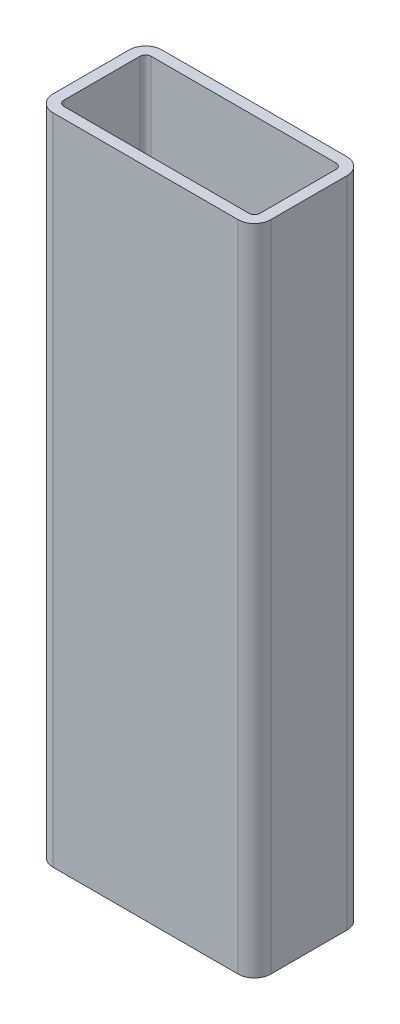
ISO-10303-21;
HEADER;
FILE_DESCRIPTION(('STEP AP214'),'2;1');
FILE_NAME('part.step','',(''),(''),'','','');
FILE_SCHEMA(('AUTOMOTIVE_DESIGN { 1 0 10303 214 1 1 1 1 }'));
ENDSEC;
DATA;
#1=APPLICATION_CONTEXT('core data for automotive mechanical design processes');
#2=APPLICATION_PROTOCOL_DEFINITION('international standard','automotive_design',2000,#1);
#3=PRODUCT_CONTEXT('',#1,'mechanical');
#4=PRODUCT('Part','Part','',(#3));
#5=PRODUCT_RELATED_PRODUCT_CATEGORY('part','',(#4));
#6=PRODUCT_DEFINITION_FORMATION('','',#4);
#7=PRODUCT_DEFINITION_CONTEXT('part definition',#1,'design');
#8=PRODUCT_DEFINITION('design','',#6,#7);
#9=PRODUCT_DEFINITION_SHAPE('','',#8);
#10=(LENGTH_UNIT() NAMED_UNIT(*) SI_UNIT(.MILLI.,.METRE.));
#11=(NAMED_UNIT(*) PLANE_ANGLE_UNIT() SI_UNIT($,.RADIAN.));
#12=(NAMED_UNIT(*) SI_UNIT($,.STERADIAN.) SOLID_ANGLE_UNIT());
#13=UNCERTAINTY_MEASURE_WITH_UNIT(LENGTH_MEASURE(1.E-05),#10,'distance_accuracy_value','');
#14=(GEOMETRIC_REPRESENTATION_CONTEXT(3) GLOBAL_UNCERTAINTY_ASSIGNED_CONTEXT((#13)) GLOBAL_UNIT_ASSIGNED_CONTEXT((#10,
#11,#12)) REPRESENTATION_CONTEXT('',''));
#15=CARTESIAN_POINT('',(0.,0.,0.));
#16=DIRECTION('',(0.,0.,1.));
#17=DIRECTION('',(1.,0.,0.));
#18=AXIS2_PLACEMENT_3D('',#15,#16,#17);
#19=CARTESIAN_POINT('',(37.,120.,-3.));
#20=DIRECTION('',(0.,1.,0.));
#21=DIRECTION('',(0.,0.,1.));
#22=AXIS2_PLACEMENT_3D('',#19,#20,#21);
#23=PLANE('',#22);
#24=CARTESIAN_POINT('',(37.,120.,-3.));
#25=DIRECTION('',(0.,1.,0.));
#26=DIRECTION('',(0.,0.,1.));
#27=AXIS2_PLACEMENT_3D('',#24,#25,#26);
#28=CIRCLE('',#27,3.);
#29=CARTESIAN_POINT('',(37.,120.,0.));
#30=VERTEX_POINT('',#29);
#31=CARTESIAN_POINT('',(40.,120.,-3.00000000000002));
#32=VERTEX_POINT('',#31);
#33=EDGE_CURVE('E262',#30,#32,#28,.T.);
#34=ORIENTED_EDGE('',*,*,#33,.T.);
#35=DIRECTION('',(0.,0.,-1.));
#36=VECTOR('',#35,1.);
#37=CARTESIAN_POINT('',(40.,120.,-3.00000000000002));
#38=LINE('',#37,#36);
#39=CARTESIAN_POINT('',(40.,120.,-17.));
#40=VERTEX_POINT('',#39);
#41=EDGE_CURVE('E265',#32,#40,#38,.T.);
#42=ORIENTED_EDGE('',*,*,#41,.T.);
#43=CARTESIAN_POINT('',(37.,120.,-17.));
#44=DIRECTION('',(0.,1.,0.));
#45=DIRECTION('',(0.,0.,1.));
#46=AXIS2_PLACEMENT_3D('',#43,#44,#45);
#47=CIRCLE('',#46,3.);
#48=CARTESIAN_POINT('',(37.,120.,-20.));
#49=VERTEX_POINT('',#48);
#50=EDGE_CURVE('E268',#40,#49,#47,.T.);
#51=ORIENTED_EDGE('',*,*,#50,.T.);
#52=DIRECTION('',(-1.,0.,0.));
#53=VECTOR('',#52,1.);
#54=CARTESIAN_POINT('',(3.00000000000002,120.,-20.));
#55=LINE('',#54,#53);
#56=CARTESIAN_POINT('',(3.,120.,-20.));
#57=VERTEX_POINT('',#56);
#58=EDGE_CURVE('E270',#49,#57,#55,.T.);
#59=ORIENTED_EDGE('',*,*,#58,.T.);
#60=CARTESIAN_POINT('',(3.,120.,-17.));
#61=DIRECTION('',(0.,1.,0.));
#62=DIRECTION('',(0.,0.,-1.));
#63=AXIS2_PLACEMENT_3D('',#60,#61,#62);
#64=CIRCLE('',#63,3.);
#65=CARTESIAN_POINT('',(0.,120.,-17.));
#66=VERTEX_POINT('',#65);
#67=EDGE_CURVE('E272',#57,#66,#64,.T.);
#68=ORIENTED_EDGE('',*,*,#67,.T.);
#69=DIRECTION('',(0.,0.,1.));
#70=VECTOR('',#69,1.);
#71=CARTESIAN_POINT('',(0.,120.,-3.00000000000002));
#72=LINE('',#71,#70);
#73=CARTESIAN_POINT('',(0.,120.,-3.00000000000002));
#74=VERTEX_POINT('',#73);
#75=EDGE_CURVE('E274',#66,#74,#72,.T.);
#76=ORIENTED_EDGE('',*,*,#75,.T.);
#77=CARTESIAN_POINT('',(3.,120.,-3.));
#78=DIRECTION('',(0.,1.,0.));
#79=DIRECTION('',(0.,0.,1.));
#80=AXIS2_PLACEMENT_3D('',#77,#78,#79);
#81=CIRCLE('',#80,3.);
#82=CARTESIAN_POINT('',(3.00000000000002,120.,0.));
#83=VERTEX_POINT('',#82);
#84=EDGE_CURVE('E276',#74,#83,#81,.T.);
#85=ORIENTED_EDGE('',*,*,#84,.T.);
#86=DIRECTION('',(1.,0.,0.));
#87=VECTOR('',#86,1.);
#88=CARTESIAN_POINT('',(3.00000000000002,120.,0.));
#89=LINE('',#88,#87);
#90=EDGE_CURVE('E278',#83,#30,#89,.T.);
#91=ORIENTED_EDGE('',*,*,#90,.T.);
#92=EDGE_LOOP('',(#34,#42,#51,#59,#68,#76,#85,#91));
#93=FACE_BOUND('',#92,.T.);
#94=DIRECTION('',(0.,0.,-1.));
#95=VECTOR('',#94,1.);
#96=CARTESIAN_POINT('',(38.,120.,-3.00000000000002));
#97=LINE('',#96,#95);
#98=CARTESIAN_POINT('',(38.,120.,-3.00000000000002));
#99=VERTEX_POINT('',#98);
#100=CARTESIAN_POINT('',(38.,120.,-17.));
#101=VERTEX_POINT('',#100);
#102=EDGE_CURVE('E205',#99,#101,#97,.T.);
#103=ORIENTED_EDGE('',*,*,#102,.F.);
#104=CARTESIAN_POINT('',(37.,120.,-3.));
#105=DIRECTION('',(0.,1.,0.));
#106=DIRECTION('',(1.,0.,0.));
#107=AXIS2_PLACEMENT_3D('',#104,#105,#106);
#108=CIRCLE('',#107,1.);
#109=CARTESIAN_POINT('',(37.,120.,-2.));
#110=VERTEX_POINT('',#109);
#111=EDGE_CURVE('E197',#110,#99,#108,.T.);
#112=ORIENTED_EDGE('',*,*,#111,.F.);
#113=DIRECTION('',(1.,0.,0.));
#114=VECTOR('',#113,1.);
#115=CARTESIAN_POINT('',(3.00000000000002,120.,-2.));
#116=LINE('',#115,#114);
#117=CARTESIAN_POINT('',(3.00000000000001,120.,-2.));
#118=VERTEX_POINT('',#117);
#119=EDGE_CURVE('E230',#118,#110,#116,.T.);
#120=ORIENTED_EDGE('',*,*,#119,.F.);
#121=CARTESIAN_POINT('',(3.,120.,-3.));
#122=DIRECTION('',(0.,1.,0.));
#123=DIRECTION('',(1.,0.,0.));
#124=AXIS2_PLACEMENT_3D('',#121,#122,#123);
#125=CIRCLE('',#124,1.);
#126=CARTESIAN_POINT('',(2.,120.,-3.00000000000002));
#127=VERTEX_POINT('',#126);
#128=EDGE_CURVE('E228',#127,#118,#125,.T.);
#129=ORIENTED_EDGE('',*,*,#128,.F.);
#130=DIRECTION('',(0.,0.,1.));
#131=VECTOR('',#130,1.);
#132=CARTESIAN_POINT('',(2.,120.,-3.00000000000002));
#133=LINE('',#132,#131);
#134=CARTESIAN_POINT('',(2.,120.,-17.));
#135=VERTEX_POINT('',#134);
#136=EDGE_CURVE('E226',#135,#127,#133,.T.);
#137=ORIENTED_EDGE('',*,*,#136,.F.);
#138=CARTESIAN_POINT('',(3.,120.,-17.));
#139=DIRECTION('',(0.,1.,0.));
#140=DIRECTION('',(1.,0.,0.));
#141=AXIS2_PLACEMENT_3D('',#138,#139,#140);
#142=CIRCLE('',#141,1.);
#143=CARTESIAN_POINT('',(3.,120.,-18.));
#144=VERTEX_POINT('',#143);
#145=EDGE_CURVE('E224',#144,#135,#142,.T.);
#146=ORIENTED_EDGE('',*,*,#145,.F.);
#147=DIRECTION('',(-1.,0.,0.));
#148=VECTOR('',#147,1.);
#149=CARTESIAN_POINT('',(3.00000000000002,120.,-18.));
#150=LINE('',#149,#148);
#151=CARTESIAN_POINT('',(37.,120.,-18.));
#152=VERTEX_POINT('',#151);
#153=EDGE_CURVE('E220',#152,#144,#150,.T.);
#154=ORIENTED_EDGE('',*,*,#153,.F.);
#155=CARTESIAN_POINT('',(37.,120.,-17.));
#156=DIRECTION('',(0.,1.,0.));
#157=DIRECTION('',(1.,0.,0.));
#158=AXIS2_PLACEMENT_3D('',#155,#156,#157);
#159=CIRCLE('',#158,1.);
#160=EDGE_CURVE('E218',#101,#152,#159,.T.);
#161=ORIENTED_EDGE('',*,*,#160,.F.);
#162=EDGE_LOOP('',(#103,#112,#120,#129,#137,#146,#154,#161));
#163=FACE_BOUND('',#162,.T.);
#164=ADVANCED_FACE('F84',(#93,#163),#23,.T.);
#165=CARTESIAN_POINT('',(37.,0.,-3.));
#166=DIRECTION('',(0.,1.,0.));
#167=DIRECTION('',(0.,0.,1.));
#168=AXIS2_PLACEMENT_3D('',#165,#166,#167);
#169=PLANE('',#168);
#170=CARTESIAN_POINT('',(37.,0.,-3.));
#171=DIRECTION('',(0.,1.,0.));
#172=DIRECTION('',(0.,0.,1.));
#173=AXIS2_PLACEMENT_3D('',#170,#171,#172);
#174=CIRCLE('',#173,3.);
#175=CARTESIAN_POINT('',(37.,0.,0.));
#176=VERTEX_POINT('',#175);
#177=CARTESIAN_POINT('',(40.,0.,-3.00000000000002));
#178=VERTEX_POINT('',#177);
#179=EDGE_CURVE('E213',#176,#178,#174,.T.);
#180=ORIENTED_EDGE('',*,*,#179,.F.);
#181=DIRECTION('',(1.,0.,0.));
#182=VECTOR('',#181,1.);
#183=CARTESIAN_POINT('',(3.00000000000002,0.,0.));
#184=LINE('',#183,#182);
#185=CARTESIAN_POINT('',(3.00000000000002,0.,0.));
#186=VERTEX_POINT('',#185);
#187=EDGE_CURVE('E266',#186,#176,#184,.T.);
#188=ORIENTED_EDGE('',*,*,#187,.F.);
#189=CARTESIAN_POINT('',(3.,0.,-3.));
#190=DIRECTION('',(0.,1.,0.));
#191=DIRECTION('',(0.,0.,1.));
#192=AXIS2_PLACEMENT_3D('',#189,#190,#191);
#193=CIRCLE('',#192,3.);
#194=CARTESIAN_POINT('',(0.,0.,-3.00000000000002));
#195=VERTEX_POINT('',#194);
#196=EDGE_CURVE('E293',#195,#186,#193,.T.);
#197=ORIENTED_EDGE('',*,*,#196,.F.);
#198=DIRECTION('',(0.,0.,1.));
#199=VECTOR('',#198,1.);
#200=CARTESIAN_POINT('',(0.,0.,-3.00000000000002));
#201=LINE('',#200,#199);
#202=CARTESIAN_POINT('',(0.,0.,-17.));
#203=VERTEX_POINT('',#202);
#204=EDGE_CURVE('E291',#203,#195,#201,.T.);
#205=ORIENTED_EDGE('',*,*,#204,.F.);
#206=CARTESIAN_POINT('',(3.,0.,-17.));
#207=DIRECTION('',(0.,1.,0.));
#208=DIRECTION('',(0.,0.,-1.));
#209=AXIS2_PLACEMENT_3D('',#206,#207,#208);
#210=CIRCLE('',#209,3.);
#211=CARTESIAN_POINT('',(3.,0.,-20.));
#212=VERTEX_POINT('',#211);
#213=EDGE_CURVE('E289',#212,#203,#210,.T.);
#214=ORIENTED_EDGE('',*,*,#213,.F.);
#215=DIRECTION('',(-1.,0.,0.));
#216=VECTOR('',#215,1.);
#217=CARTESIAN_POINT('',(3.00000000000002,0.,-20.));
#218=LINE('',#217,#216);
#219=CARTESIAN_POINT('',(37.,0.,-20.));
#220=VERTEX_POINT('',#219);
#221=EDGE_CURVE('E287',#220,#212,#218,.T.);
#222=ORIENTED_EDGE('',*,*,#221,.F.);
#223=CARTESIAN_POINT('',(37.,0.,-17.));
#224=DIRECTION('',(0.,1.,0.));
#225=DIRECTION('',(0.,0.,1.));
#226=AXIS2_PLACEMENT_3D('',#223,#224,#225);
#227=CIRCLE('',#226,3.);
#228=CARTESIAN_POINT('',(40.,0.,-17.));
#229=VERTEX_POINT('',#228);
#230=EDGE_CURVE('E285',#229,#220,#227,.T.);
#231=ORIENTED_EDGE('',*,*,#230,.F.);
#232=DIRECTION('',(0.,0.,-1.));
#233=VECTOR('',#232,1.);
#234=CARTESIAN_POINT('',(40.,0.,-3.00000000000002));
#235=LINE('',#234,#233);
#236=EDGE_CURVE('E283',#178,#229,#235,.T.);
#237=ORIENTED_EDGE('',*,*,#236,.F.);
#238=EDGE_LOOP('',(#180,#188,#197,#205,#214,#222,#231,#237));
#239=FACE_BOUND('',#238,.T.);
#240=CARTESIAN_POINT('',(37.,0.,-3.));
#241=DIRECTION('',(0.,1.,0.));
#242=DIRECTION('',(1.,0.,0.));
#243=AXIS2_PLACEMENT_3D('',#240,#241,#242);
#244=CIRCLE('',#243,1.);
#245=CARTESIAN_POINT('',(37.,0.,-2.));
#246=VERTEX_POINT('',#245);
#247=CARTESIAN_POINT('',(38.,0.,-3.00000000000002));
#248=VERTEX_POINT('',#247);
#249=EDGE_CURVE('E107',#246,#248,#244,.T.);
#250=ORIENTED_EDGE('',*,*,#249,.T.);
#251=DIRECTION('',(0.,0.,-1.));
#252=VECTOR('',#251,1.);
#253=CARTESIAN_POINT('',(38.,0.,-3.00000000000002));
#254=LINE('',#253,#252);
#255=CARTESIAN_POINT('',(38.,0.,-17.));
#256=VERTEX_POINT('',#255);
#257=EDGE_CURVE('E212',#248,#256,#254,.T.);
#258=ORIENTED_EDGE('',*,*,#257,.T.);
#259=CARTESIAN_POINT('',(37.,0.,-17.));
#260=DIRECTION('',(0.,1.,0.));
#261=DIRECTION('',(1.,0.,0.));
#262=AXIS2_PLACEMENT_3D('',#259,#260,#261);
#263=CIRCLE('',#262,1.);
#264=CARTESIAN_POINT('',(37.,0.,-18.));
#265=VERTEX_POINT('',#264);
#266=EDGE_CURVE('E234',#256,#265,#263,.T.);
#267=ORIENTED_EDGE('',*,*,#266,.T.);
#268=DIRECTION('',(-1.,0.,0.));
#269=VECTOR('',#268,1.);
#270=CARTESIAN_POINT('',(3.00000000000002,0.,-18.));
#271=LINE('',#270,#269);
#272=CARTESIAN_POINT('',(3.,0.,-18.));
#273=VERTEX_POINT('',#272);
#274=EDGE_CURVE('E237',#265,#273,#271,.T.);
#275=ORIENTED_EDGE('',*,*,#274,.T.);
#276=CARTESIAN_POINT('',(3.,0.,-17.));
#277=DIRECTION('',(0.,1.,0.));
#278=DIRECTION('',(1.,0.,0.));
#279=AXIS2_PLACEMENT_3D('',#276,#277,#278);
#280=CIRCLE('',#279,1.);
#281=CARTESIAN_POINT('',(2.,0.,-17.));
#282=VERTEX_POINT('',#281);
#283=EDGE_CURVE('E240',#273,#282,#280,.T.);
#284=ORIENTED_EDGE('',*,*,#283,.T.);
#285=DIRECTION('',(0.,0.,1.));
#286=VECTOR('',#285,1.);
#287=CARTESIAN_POINT('',(2.,0.,-3.00000000000002));
#288=LINE('',#287,#286);
#289=CARTESIAN_POINT('',(2.,0.,-3.00000000000002));
#290=VERTEX_POINT('',#289);
#291=EDGE_CURVE('E243',#282,#290,#288,.T.);
#292=ORIENTED_EDGE('',*,*,#291,.T.);
#293=CARTESIAN_POINT('',(3.,0.,-3.));
#294=DIRECTION('',(0.,1.,0.));
#295=DIRECTION('',(1.,0.,0.));
#296=AXIS2_PLACEMENT_3D('',#293,#294,#295);
#297=CIRCLE('',#296,1.);
#298=CARTESIAN_POINT('',(3.00000000000001,0.,-2.));
#299=VERTEX_POINT('',#298);
#300=EDGE_CURVE('E246',#290,#299,#297,.T.);
#301=ORIENTED_EDGE('',*,*,#300,.T.);
#302=DIRECTION('',(1.,0.,0.));
#303=VECTOR('',#302,1.);
#304=CARTESIAN_POINT('',(3.00000000000002,0.,-2.));
#305=LINE('',#304,#303);
#306=EDGE_CURVE('E206',#299,#246,#305,.T.);
#307=ORIENTED_EDGE('',*,*,#306,.T.);
#308=EDGE_LOOP('',(#250,#258,#267,#275,#284,#292,#301,#307));
#309=FACE_BOUND('',#308,.T.);
#310=ADVANCED_FACE('F323',(#239,#309),#169,.F.);
#311=CARTESIAN_POINT('',(37.,120.,-3.));
#312=DIRECTION('',(0.,-1.,0.));
#313=DIRECTION('',(0.,0.,-1.));
#314=AXIS2_PLACEMENT_3D('',#311,#312,#313);
#315=CYLINDRICAL_SURFACE('',#314,3.);
#316=ORIENTED_EDGE('',*,*,#179,.T.);
#317=DIRECTION('',(0.,-1.,0.));
#318=VECTOR('',#317,1.);
#319=CARTESIAN_POINT('',(40.,120.,-3.00000000000002));
#320=LINE('',#319,#318);
#321=EDGE_CURVE('E12',#32,#178,#320,.T.);
#322=ORIENTED_EDGE('',*,*,#321,.F.);
#323=ORIENTED_EDGE('',*,*,#33,.F.);
#324=DIRECTION('',(0.,-1.,0.));
#325=VECTOR('',#324,1.);
#326=CARTESIAN_POINT('',(37.,120.,0.));
#327=LINE('',#326,#325);
#328=EDGE_CURVE('E280',#30,#176,#327,.T.);
#329=ORIENTED_EDGE('',*,*,#328,.T.);
#330=EDGE_LOOP('',(#316,#322,#323,#329));
#331=FACE_BOUND('',#330,.T.);
#332=ADVANCED_FACE('F86',(#331),#315,.T.);
#333=CARTESIAN_POINT('',(40.,120.,-3.00000000000002));
#334=DIRECTION('',(-1.,0.,0.));
#335=DIRECTION('',(0.,0.,1.));
#336=AXIS2_PLACEMENT_3D('',#333,#334,#335);
#337=PLANE('',#336);
#338=ORIENTED_EDGE('',*,*,#236,.T.);
#339=DIRECTION('',(0.,-1.,0.));
#340=VECTOR('',#339,1.);
#341=CARTESIAN_POINT('',(40.,120.,-17.));
#342=LINE('',#341,#340);
#343=EDGE_CURVE('E92',#40,#229,#342,.T.);
#344=ORIENTED_EDGE('',*,*,#343,.F.);
#345=ORIENTED_EDGE('',*,*,#41,.F.);
#346=ORIENTED_EDGE('',*,*,#321,.T.);
#347=EDGE_LOOP('',(#338,#344,#345,#346));
#348=FACE_BOUND('',#347,.T.);
#349=ADVANCED_FACE('F340',(#348),#337,.F.);
#350=CARTESIAN_POINT('',(37.,120.,-17.));
#351=DIRECTION('',(0.,-1.,0.));
#352=DIRECTION('',(0.,0.,-1.));
#353=AXIS2_PLACEMENT_3D('',#350,#351,#352);
#354=CYLINDRICAL_SURFACE('',#353,3.);
#355=ORIENTED_EDGE('',*,*,#230,.T.);
#356=DIRECTION('',(0.,-1.,0.));
#357=VECTOR('',#356,1.);
#358=CARTESIAN_POINT('',(37.,120.,-20.));
#359=LINE('',#358,#357);
#360=EDGE_CURVE('E310',#49,#220,#359,.T.);
#361=ORIENTED_EDGE('',*,*,#360,.F.);
#362=ORIENTED_EDGE('',*,*,#50,.F.);
#363=ORIENTED_EDGE('',*,*,#343,.T.);
#364=EDGE_LOOP('',(#355,#361,#362,#363));
#365=FACE_BOUND('',#364,.T.);
#366=ADVANCED_FACE('F317',(#365),#354,.T.);
#367=CARTESIAN_POINT('',(3.00000000000002,120.,-20.));
#368=DIRECTION('',(0.,0.,1.));
#369=DIRECTION('',(1.,0.,0.));
#370=AXIS2_PLACEMENT_3D('',#367,#368,#369);
#371=PLANE('',#370);
#372=ORIENTED_EDGE('',*,*,#221,.T.);
#373=DIRECTION('',(0.,-1.,0.));
#374=VECTOR('',#373,1.);
#375=CARTESIAN_POINT('',(3.,120.,-20.));
#376=LINE('',#375,#374);
#377=EDGE_CURVE('E307',#57,#212,#376,.T.);
#378=ORIENTED_EDGE('',*,*,#377,.F.);
#379=ORIENTED_EDGE('',*,*,#58,.F.);
#380=ORIENTED_EDGE('',*,*,#360,.T.);
#381=EDGE_LOOP('',(#372,#378,#379,#380));
#382=FACE_BOUND('',#381,.T.);
#383=ADVANCED_FACE('F329',(#382),#371,.F.);
#384=CARTESIAN_POINT('',(3.,120.,-17.));
#385=DIRECTION('',(0.,-1.,0.));
#386=DIRECTION('',(0.,0.,-1.));
#387=AXIS2_PLACEMENT_3D('',#384,#385,#386);
#388=CYLINDRICAL_SURFACE('',#387,3.);
#389=ORIENTED_EDGE('',*,*,#213,.T.);
#390=DIRECTION('',(0.,-1.,0.));
#391=VECTOR('',#390,1.);
#392=CARTESIAN_POINT('',(0.,120.,-17.));
#393=LINE('',#392,#391);
#394=EDGE_CURVE('E304',#66,#203,#393,.T.);
#395=ORIENTED_EDGE('',*,*,#394,.F.);
#396=ORIENTED_EDGE('',*,*,#67,.F.);
#397=ORIENTED_EDGE('',*,*,#377,.T.);
#398=EDGE_LOOP('',(#389,#395,#396,#397));
#399=FACE_BOUND('',#398,.T.);
#400=ADVANCED_FACE('F333',(#399),#388,.T.);
#401=CARTESIAN_POINT('',(0.,120.,-3.00000000000002));
#402=DIRECTION('',(1.,0.,0.));
#403=DIRECTION('',(0.,0.,-1.));
#404=AXIS2_PLACEMENT_3D('',#401,#402,#403);
#405=PLANE('',#404);
#406=ORIENTED_EDGE('',*,*,#204,.T.);
#407=DIRECTION('',(0.,-1.,0.));
#408=VECTOR('',#407,1.);
#409=CARTESIAN_POINT('',(0.,120.,-3.00000000000002));
#410=LINE('',#409,#408);
#411=EDGE_CURVE('E301',#74,#195,#410,.T.);
#412=ORIENTED_EDGE('',*,*,#411,.F.);
#413=ORIENTED_EDGE('',*,*,#75,.F.);
#414=ORIENTED_EDGE('',*,*,#394,.T.);
#415=EDGE_LOOP('',(#406,#412,#413,#414));
#416=FACE_BOUND('',#415,.T.);
#417=ADVANCED_FACE('F353',(#416),#405,.F.);
#418=CARTESIAN_POINT('',(3.,120.,-3.));
#419=DIRECTION('',(0.,-1.,0.));
#420=DIRECTION('',(0.,0.,-1.));
#421=AXIS2_PLACEMENT_3D('',#418,#419,#420);
#422=CYLINDRICAL_SURFACE('',#421,3.);
#423=ORIENTED_EDGE('',*,*,#196,.T.);
#424=DIRECTION('',(0.,-1.,0.));
#425=VECTOR('',#424,1.);
#426=CARTESIAN_POINT('',(3.00000000000002,120.,0.));
#427=LINE('',#426,#425);
#428=EDGE_CURVE('E298',#83,#186,#427,.T.);
#429=ORIENTED_EDGE('',*,*,#428,.F.);
#430=ORIENTED_EDGE('',*,*,#84,.F.);
#431=ORIENTED_EDGE('',*,*,#411,.T.);
#432=EDGE_LOOP('',(#423,#429,#430,#431));
#433=FACE_BOUND('',#432,.T.);
#434=ADVANCED_FACE('F351',(#433),#422,.T.);
#435=CARTESIAN_POINT('',(3.00000000000002,120.,0.));
#436=DIRECTION('',(0.,0.,-1.));
#437=DIRECTION('',(-1.,0.,0.));
#438=AXIS2_PLACEMENT_3D('',#435,#436,#437);
#439=PLANE('',#438);
#440=ORIENTED_EDGE('',*,*,#187,.T.);
#441=ORIENTED_EDGE('',*,*,#328,.F.);
#442=ORIENTED_EDGE('',*,*,#90,.F.);
#443=ORIENTED_EDGE('',*,*,#428,.T.);
#444=EDGE_LOOP('',(#440,#441,#442,#443));
#445=FACE_BOUND('',#444,.T.);
#446=ADVANCED_FACE('F346',(#445),#439,.F.);
#447=CARTESIAN_POINT('',(37.,120.,-3.));
#448=DIRECTION('',(0.,-1.,0.));
#449=DIRECTION('',(0.,0.,-1.));
#450=AXIS2_PLACEMENT_3D('',#447,#448,#449);
#451=CYLINDRICAL_SURFACE('',#450,1.);
#452=ORIENTED_EDGE('',*,*,#249,.F.);
#453=DIRECTION('',(0.,-1.,0.));
#454=VECTOR('',#453,1.);
#455=CARTESIAN_POINT('',(37.,120.,-2.));
#456=LINE('',#455,#454);
#457=EDGE_CURVE('E201',#110,#246,#456,.T.);
#458=ORIENTED_EDGE('',*,*,#457,.F.);
#459=ORIENTED_EDGE('',*,*,#111,.T.);
#460=DIRECTION('',(0.,-1.,0.));
#461=VECTOR('',#460,1.);
#462=CARTESIAN_POINT('',(38.,120.,-3.00000000000002));
#463=LINE('',#462,#461);
#464=EDGE_CURVE('E200',#99,#248,#463,.T.);
#465=ORIENTED_EDGE('',*,*,#464,.T.);
#466=EDGE_LOOP('',(#452,#458,#459,#465));
#467=FACE_BOUND('',#466,.T.);
#468=ADVANCED_FACE('F199',(#467),#451,.F.);
#469=CARTESIAN_POINT('',(38.,120.,-3.00000000000002));
#470=DIRECTION('',(-1.,0.,0.));
#471=DIRECTION('',(0.,0.,1.));
#472=AXIS2_PLACEMENT_3D('',#469,#470,#471);
#473=PLANE('',#472);
#474=ORIENTED_EDGE('',*,*,#257,.F.);
#475=ORIENTED_EDGE('',*,*,#464,.F.);
#476=ORIENTED_EDGE('',*,*,#102,.T.);
#477=DIRECTION('',(0.,-1.,0.));
#478=VECTOR('',#477,1.);
#479=CARTESIAN_POINT('',(38.,120.,-17.));
#480=LINE('',#479,#478);
#481=EDGE_CURVE('E214',#101,#256,#480,.T.);
#482=ORIENTED_EDGE('',*,*,#481,.T.);
#483=EDGE_LOOP('',(#474,#475,#476,#482));
#484=FACE_BOUND('',#483,.T.);
#485=ADVANCED_FACE('F209',(#484),#473,.T.);
#486=CARTESIAN_POINT('',(37.,120.,-17.));
#487=DIRECTION('',(0.,-1.,0.));
#488=DIRECTION('',(0.,0.,-1.));
#489=AXIS2_PLACEMENT_3D('',#486,#487,#488);
#490=CYLINDRICAL_SURFACE('',#489,1.);
#491=ORIENTED_EDGE('',*,*,#266,.F.);
#492=ORIENTED_EDGE('',*,*,#481,.F.);
#493=ORIENTED_EDGE('',*,*,#160,.T.);
#494=DIRECTION('',(0.,-1.,0.));
#495=VECTOR('',#494,1.);
#496=CARTESIAN_POINT('',(37.,120.,-18.));
#497=LINE('',#496,#495);
#498=EDGE_CURVE('E259',#152,#265,#497,.T.);
#499=ORIENTED_EDGE('',*,*,#498,.T.);
#500=EDGE_LOOP('',(#491,#492,#493,#499));
#501=FACE_BOUND('',#500,.T.);
#502=ADVANCED_FACE('F378',(#501),#490,.F.);
#503=CARTESIAN_POINT('',(3.00000000000002,120.,-18.));
#504=DIRECTION('',(0.,0.,1.));
#505=DIRECTION('',(1.,0.,0.));
#506=AXIS2_PLACEMENT_3D('',#503,#504,#505);
#507=PLANE('',#506);
#508=ORIENTED_EDGE('',*,*,#274,.F.);
#509=ORIENTED_EDGE('',*,*,#498,.F.);
#510=ORIENTED_EDGE('',*,*,#153,.T.);
#511=DIRECTION('',(0.,-1.,0.));
#512=VECTOR('',#511,1.);
#513=CARTESIAN_POINT('',(3.,120.,-18.));
#514=LINE('',#513,#512);
#515=EDGE_CURVE('E257',#144,#273,#514,.T.);
#516=ORIENTED_EDGE('',*,*,#515,.T.);
#517=EDGE_LOOP('',(#508,#509,#510,#516));
#518=FACE_BOUND('',#517,.T.);
#519=ADVANCED_FACE('F382',(#518),#507,.T.);
#520=CARTESIAN_POINT('',(3.,120.,-17.));
#521=DIRECTION('',(0.,-1.,0.));
#522=DIRECTION('',(0.,0.,-1.));
#523=AXIS2_PLACEMENT_3D('',#520,#521,#522);
#524=CYLINDRICAL_SURFACE('',#523,1.);
#525=ORIENTED_EDGE('',*,*,#283,.F.);
#526=ORIENTED_EDGE('',*,*,#515,.F.);
#527=ORIENTED_EDGE('',*,*,#145,.T.);
#528=DIRECTION('',(0.,-1.,0.));
#529=VECTOR('',#528,1.);
#530=CARTESIAN_POINT('',(2.,120.,-17.));
#531=LINE('',#530,#529);
#532=EDGE_CURVE('E255',#135,#282,#531,.T.);
#533=ORIENTED_EDGE('',*,*,#532,.T.);
#534=EDGE_LOOP('',(#525,#526,#527,#533));
#535=FACE_BOUND('',#534,.T.);
#536=ADVANCED_FACE('F388',(#535),#524,.F.);
#537=CARTESIAN_POINT('',(2.,120.,-3.00000000000002));
#538=DIRECTION('',(1.,0.,0.));
#539=DIRECTION('',(0.,0.,-1.));
#540=AXIS2_PLACEMENT_3D('',#537,#538,#539);
#541=PLANE('',#540);
#542=ORIENTED_EDGE('',*,*,#291,.F.);
#543=ORIENTED_EDGE('',*,*,#532,.F.);
#544=ORIENTED_EDGE('',*,*,#136,.T.);
#545=DIRECTION('',(0.,-1.,0.));
#546=VECTOR('',#545,1.);
#547=CARTESIAN_POINT('',(2.,120.,-3.00000000000002));
#548=LINE('',#547,#546);
#549=EDGE_CURVE('E253',#127,#290,#548,.T.);
#550=ORIENTED_EDGE('',*,*,#549,.T.);
#551=EDGE_LOOP('',(#542,#543,#544,#550));
#552=FACE_BOUND('',#551,.T.);
#553=ADVANCED_FACE('F392',(#552),#541,.T.);
#554=CARTESIAN_POINT('',(3.,120.,-3.));
#555=DIRECTION('',(0.,-1.,0.));
#556=DIRECTION('',(0.,0.,-1.));
#557=AXIS2_PLACEMENT_3D('',#554,#555,#556);
#558=CYLINDRICAL_SURFACE('',#557,1.);
#559=ORIENTED_EDGE('',*,*,#300,.F.);
#560=ORIENTED_EDGE('',*,*,#549,.F.);
#561=ORIENTED_EDGE('',*,*,#128,.T.);
#562=DIRECTION('',(0.,-1.,0.));
#563=VECTOR('',#562,1.);
#564=CARTESIAN_POINT('',(3.00000000000001,120.,-2.));
#565=LINE('',#564,#563);
#566=EDGE_CURVE('E99',#118,#299,#565,.T.);
#567=ORIENTED_EDGE('',*,*,#566,.T.);
#568=EDGE_LOOP('',(#559,#560,#561,#567));
#569=FACE_BOUND('',#568,.T.);
#570=ADVANCED_FACE('F396',(#569),#558,.F.);
#571=CARTESIAN_POINT('',(3.00000000000002,120.,-2.));
#572=DIRECTION('',(0.,0.,-1.));
#573=DIRECTION('',(-1.,0.,0.));
#574=AXIS2_PLACEMENT_3D('',#571,#572,#573);
#575=PLANE('',#574);
#576=ORIENTED_EDGE('',*,*,#306,.F.);
#577=ORIENTED_EDGE('',*,*,#566,.F.);
#578=ORIENTED_EDGE('',*,*,#119,.T.);
#579=ORIENTED_EDGE('',*,*,#457,.T.);
#580=EDGE_LOOP('',(#576,#577,#578,#579));
#581=FACE_BOUND('',#580,.T.);
#582=ADVANCED_FACE('F400',(#581),#575,.T.);
#583=CLOSED_SHELL('',(#164,#310,#332,#349,#366,#383,#400,#417,#434,#446,#468,#485,#502,#519,
#536,#553,#570,#582));
#584=MANIFOLD_SOLID_BREP('B2',#583);
#585=ADVANCED_BREP_SHAPE_REPRESENTATION('',(#18,#584),#14);
#586=SHAPE_DEFINITION_REPRESENTATION(#9,#585);
ENDSEC;
END-ISO-10303-21;
